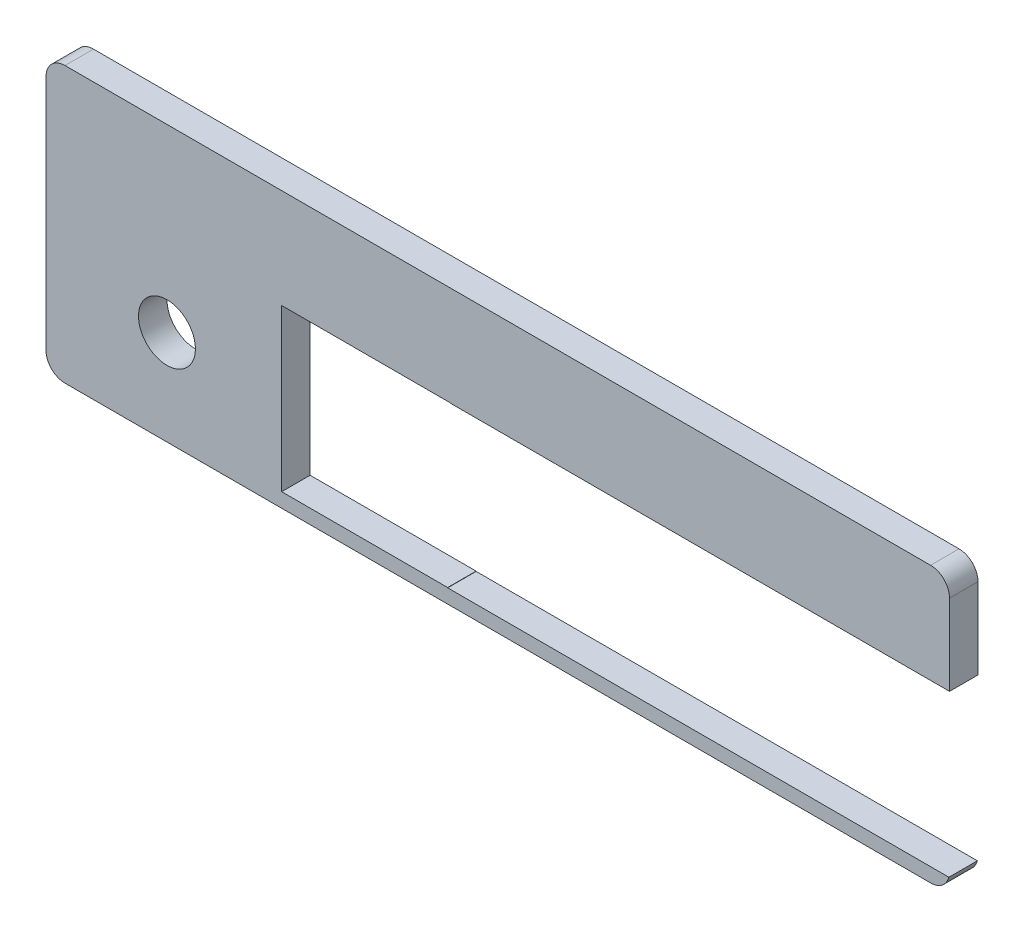
ISO-10303-21;
HEADER;
FILE_DESCRIPTION(('STEP AP214'),'2;1');
FILE_NAME('part.step','',(''),(''),'','','');
FILE_SCHEMA(('AUTOMOTIVE_DESIGN { 1 0 10303 214 1 1 1 1 }'));
ENDSEC;
DATA;
#1=APPLICATION_CONTEXT('core data for automotive mechanical design processes');
#2=APPLICATION_PROTOCOL_DEFINITION('international standard','automotive_design',2000,#1);
#3=PRODUCT_CONTEXT('',#1,'mechanical');
#4=PRODUCT('Part','Part','',(#3));
#5=PRODUCT_RELATED_PRODUCT_CATEGORY('part','',(#4));
#6=PRODUCT_DEFINITION_FORMATION('','',#4);
#7=PRODUCT_DEFINITION_CONTEXT('part definition',#1,'design');
#8=PRODUCT_DEFINITION('design','',#6,#7);
#9=PRODUCT_DEFINITION_SHAPE('','',#8);
#10=(LENGTH_UNIT() NAMED_UNIT(*) SI_UNIT(.MILLI.,.METRE.));
#11=(NAMED_UNIT(*) PLANE_ANGLE_UNIT() SI_UNIT($,.RADIAN.));
#12=(NAMED_UNIT(*) SI_UNIT($,.STERADIAN.) SOLID_ANGLE_UNIT());
#13=UNCERTAINTY_MEASURE_WITH_UNIT(LENGTH_MEASURE(1.E-05),#10,'distance_accuracy_value','');
#14=(GEOMETRIC_REPRESENTATION_CONTEXT(3) GLOBAL_UNCERTAINTY_ASSIGNED_CONTEXT((#13)) GLOBAL_UNIT_ASSIGNED_CONTEXT((#10,
#11,#12)) REPRESENTATION_CONTEXT('',''));
#15=CARTESIAN_POINT('',(0.,0.,0.));
#16=DIRECTION('',(0.,0.,1.));
#17=DIRECTION('',(1.,0.,0.));
#18=AXIS2_PLACEMENT_3D('',#15,#16,#17);
#19=CARTESIAN_POINT('',(46.,0.,3.));
#20=DIRECTION('',(-1.,0.,0.));
#21=DIRECTION('',(0.,0.,1.));
#22=AXIS2_PLACEMENT_3D('',#19,#20,#21);
#23=PLANE('',#22);
#24=DIRECTION('',(0.,1.,0.));
#25=VECTOR('',#24,1.);
#26=CARTESIAN_POINT('',(46.,0.,0.));
#27=LINE('',#26,#25);
#28=CARTESIAN_POINT('',(46.,9.23630902923453,0.));
#29=VERTEX_POINT('',#28);
#30=CARTESIAN_POINT('',(46.,17.75,0.));
#31=VERTEX_POINT('',#30);
#32=EDGE_CURVE('E177',#29,#31,#27,.T.);
#33=ORIENTED_EDGE('',*,*,#32,.T.);
#34=DIRECTION('',(0.,0.,-1.));
#35=VECTOR('',#34,1.);
#36=CARTESIAN_POINT('',(46.,17.75,3.));
#37=LINE('',#36,#35);
#38=CARTESIAN_POINT('',(46.,17.75,3.));
#39=VERTEX_POINT('',#38);
#40=EDGE_CURVE('E11',#39,#31,#37,.T.);
#41=ORIENTED_EDGE('',*,*,#40,.F.);
#42=DIRECTION('',(0.,1.,0.));
#43=VECTOR('',#42,1.);
#44=CARTESIAN_POINT('',(46.,0.,3.));
#45=LINE('',#44,#43);
#46=CARTESIAN_POINT('',(46.,9.23630902923453,3.));
#47=VERTEX_POINT('',#46);
#48=EDGE_CURVE('E474',#47,#39,#45,.T.);
#49=ORIENTED_EDGE('',*,*,#48,.F.);
#50=DIRECTION('',(0.,0.,-1.));
#51=VECTOR('',#50,1.);
#52=CARTESIAN_POINT('',(46.,9.23630902923453,3.));
#53=LINE('',#52,#51);
#54=EDGE_CURVE('E51',#47,#29,#53,.T.);
#55=ORIENTED_EDGE('',*,*,#54,.T.);
#56=EDGE_LOOP('',(#33,#41,#49,#55));
#57=FACE_BOUND('',#56,.T.);
#58=ADVANCED_FACE('F34',(#57),#23,.F.);
#59=CARTESIAN_POINT('',(44.,17.75,3.));
#60=DIRECTION('',(0.,0.,-1.));
#61=DIRECTION('',(-1.,0.,0.));
#62=AXIS2_PLACEMENT_3D('',#59,#60,#61);
#63=CYLINDRICAL_SURFACE('',#62,2.);
#64=CARTESIAN_POINT('',(44.,17.75,0.));
#65=DIRECTION('',(0.,0.,1.));
#66=DIRECTION('',(1.,0.,0.));
#67=AXIS2_PLACEMENT_3D('',#64,#65,#66);
#68=CIRCLE('',#67,2.);
#69=CARTESIAN_POINT('',(44.,19.75,0.));
#70=VERTEX_POINT('',#69);
#71=EDGE_CURVE('E179',#31,#70,#68,.T.);
#72=ORIENTED_EDGE('',*,*,#71,.T.);
#73=DIRECTION('',(0.,0.,-1.));
#74=VECTOR('',#73,1.);
#75=CARTESIAN_POINT('',(44.,19.75,3.));
#76=LINE('',#75,#74);
#77=CARTESIAN_POINT('',(44.,19.75,3.));
#78=VERTEX_POINT('',#77);
#79=EDGE_CURVE('E43',#78,#70,#76,.T.);
#80=ORIENTED_EDGE('',*,*,#79,.F.);
#81=CARTESIAN_POINT('',(44.,17.75,3.));
#82=DIRECTION('',(0.,0.,1.));
#83=DIRECTION('',(1.,0.,0.));
#84=AXIS2_PLACEMENT_3D('',#81,#82,#83);
#85=CIRCLE('',#84,2.);
#86=EDGE_CURVE('E110',#39,#78,#85,.T.);
#87=ORIENTED_EDGE('',*,*,#86,.F.);
#88=ORIENTED_EDGE('',*,*,#40,.T.);
#89=EDGE_LOOP('',(#72,#80,#87,#88));
#90=FACE_BOUND('',#89,.T.);
#91=ADVANCED_FACE('F296',(#90),#63,.T.);
#92=CARTESIAN_POINT('',(0.,19.75,3.));
#93=DIRECTION('',(0.,-1.,0.));
#94=DIRECTION('',(1.,0.,0.));
#95=AXIS2_PLACEMENT_3D('',#92,#93,#94);
#96=PLANE('',#95);
#97=DIRECTION('',(-1.,0.,0.));
#98=VECTOR('',#97,1.);
#99=CARTESIAN_POINT('',(0.,19.75,0.));
#100=LINE('',#99,#98);
#101=CARTESIAN_POINT('',(-47.25,19.75,0.));
#102=VERTEX_POINT('',#101);
#103=EDGE_CURVE('E181',#70,#102,#100,.T.);
#104=ORIENTED_EDGE('',*,*,#103,.T.);
#105=DIRECTION('',(0.,0.,-1.));
#106=VECTOR('',#105,1.);
#107=CARTESIAN_POINT('',(-47.25,19.75,3.));
#108=LINE('',#107,#106);
#109=CARTESIAN_POINT('',(-47.25,19.75,3.));
#110=VERTEX_POINT('',#109);
#111=EDGE_CURVE('E236',#110,#102,#108,.T.);
#112=ORIENTED_EDGE('',*,*,#111,.F.);
#113=DIRECTION('',(-1.,0.,0.));
#114=VECTOR('',#113,1.);
#115=CARTESIAN_POINT('',(0.,19.75,3.));
#116=LINE('',#115,#114);
#117=EDGE_CURVE('E244',#78,#110,#116,.T.);
#118=ORIENTED_EDGE('',*,*,#117,.F.);
#119=ORIENTED_EDGE('',*,*,#79,.T.);
#120=EDGE_LOOP('',(#104,#112,#118,#119));
#121=FACE_BOUND('',#120,.T.);
#122=ADVANCED_FACE('F242',(#121),#96,.F.);
#123=CARTESIAN_POINT('',(-47.25,17.75,3.));
#124=DIRECTION('',(0.,0.,-1.));
#125=DIRECTION('',(-1.,0.,0.));
#126=AXIS2_PLACEMENT_3D('',#123,#124,#125);
#127=CYLINDRICAL_SURFACE('',#126,2.00000000000001);
#128=CARTESIAN_POINT('',(-47.25,17.75,0.));
#129=DIRECTION('',(0.,0.,1.));
#130=DIRECTION('',(1.,0.,0.));
#131=AXIS2_PLACEMENT_3D('',#128,#129,#130);
#132=CIRCLE('',#131,2.00000000000001);
#133=CARTESIAN_POINT('',(-49.25,17.75,0.));
#134=VERTEX_POINT('',#133);
#135=EDGE_CURVE('E183',#102,#134,#132,.T.);
#136=ORIENTED_EDGE('',*,*,#135,.T.);
#137=DIRECTION('',(0.,0.,-1.));
#138=VECTOR('',#137,1.);
#139=CARTESIAN_POINT('',(-49.25,17.75,3.));
#140=LINE('',#139,#138);
#141=CARTESIAN_POINT('',(-49.25,17.75,3.));
#142=VERTEX_POINT('',#141);
#143=EDGE_CURVE('E233',#142,#134,#140,.T.);
#144=ORIENTED_EDGE('',*,*,#143,.F.);
#145=CARTESIAN_POINT('',(-47.25,17.75,3.));
#146=DIRECTION('',(0.,0.,1.));
#147=DIRECTION('',(1.,0.,0.));
#148=AXIS2_PLACEMENT_3D('',#145,#146,#147);
#149=CIRCLE('',#148,2.00000000000001);
#150=EDGE_CURVE('E261',#110,#142,#149,.T.);
#151=ORIENTED_EDGE('',*,*,#150,.F.);
#152=ORIENTED_EDGE('',*,*,#111,.T.);
#153=EDGE_LOOP('',(#136,#144,#151,#152));
#154=FACE_BOUND('',#153,.T.);
#155=ADVANCED_FACE('F252',(#154),#127,.T.);
#156=CARTESIAN_POINT('',(-49.25,0.,3.));
#157=DIRECTION('',(1.,0.,0.));
#158=DIRECTION('',(0.,1.,0.));
#159=AXIS2_PLACEMENT_3D('',#156,#157,#158);
#160=PLANE('',#159);
#161=DIRECTION('',(0.,-1.,0.));
#162=VECTOR('',#161,1.);
#163=CARTESIAN_POINT('',(-49.25,0.,0.));
#164=LINE('',#163,#162);
#165=CARTESIAN_POINT('',(-49.25,-7.25,0.));
#166=VERTEX_POINT('',#165);
#167=EDGE_CURVE('E185',#134,#166,#164,.T.);
#168=ORIENTED_EDGE('',*,*,#167,.T.);
#169=DIRECTION('',(0.,0.,-1.));
#170=VECTOR('',#169,1.);
#171=CARTESIAN_POINT('',(-49.25,-7.25,3.));
#172=LINE('',#171,#170);
#173=CARTESIAN_POINT('',(-49.25,-7.25,3.));
#174=VERTEX_POINT('',#173);
#175=EDGE_CURVE('E230',#174,#166,#172,.T.);
#176=ORIENTED_EDGE('',*,*,#175,.F.);
#177=DIRECTION('',(0.,-1.,0.));
#178=VECTOR('',#177,1.);
#179=CARTESIAN_POINT('',(-49.25,0.,3.));
#180=LINE('',#179,#178);
#181=EDGE_CURVE('E258',#142,#174,#180,.T.);
#182=ORIENTED_EDGE('',*,*,#181,.F.);
#183=ORIENTED_EDGE('',*,*,#143,.T.);
#184=EDGE_LOOP('',(#168,#176,#182,#183));
#185=FACE_BOUND('',#184,.T.);
#186=ADVANCED_FACE('F256',(#185),#160,.F.);
#187=CARTESIAN_POINT('',(-47.25,-7.25,3.));
#188=DIRECTION('',(0.,0.,-1.));
#189=DIRECTION('',(-1.,0.,0.));
#190=AXIS2_PLACEMENT_3D('',#187,#188,#189);
#191=CYLINDRICAL_SURFACE('',#190,1.99999999999999);
#192=CARTESIAN_POINT('',(-47.25,-7.25,0.));
#193=DIRECTION('',(0.,0.,1.));
#194=DIRECTION('',(1.,0.,0.));
#195=AXIS2_PLACEMENT_3D('',#192,#193,#194);
#196=CIRCLE('',#195,1.99999999999999);
#197=CARTESIAN_POINT('',(-47.25,-9.25,0.));
#198=VERTEX_POINT('',#197);
#199=EDGE_CURVE('E187',#166,#198,#196,.T.);
#200=ORIENTED_EDGE('',*,*,#199,.T.);
#201=DIRECTION('',(0.,0.,-1.));
#202=VECTOR('',#201,1.);
#203=CARTESIAN_POINT('',(-47.25,-9.25,3.));
#204=LINE('',#203,#202);
#205=CARTESIAN_POINT('',(-47.25,-9.25,3.));
#206=VERTEX_POINT('',#205);
#207=EDGE_CURVE('E227',#206,#198,#204,.T.);
#208=ORIENTED_EDGE('',*,*,#207,.F.);
#209=CARTESIAN_POINT('',(-47.25,-7.25,3.));
#210=DIRECTION('',(0.,0.,1.));
#211=DIRECTION('',(1.,0.,0.));
#212=AXIS2_PLACEMENT_3D('',#209,#210,#211);
#213=CIRCLE('',#212,1.99999999999999);
#214=EDGE_CURVE('E260',#174,#206,#213,.T.);
#215=ORIENTED_EDGE('',*,*,#214,.F.);
#216=ORIENTED_EDGE('',*,*,#175,.T.);
#217=EDGE_LOOP('',(#200,#208,#215,#216));
#218=FACE_BOUND('',#217,.T.);
#219=ADVANCED_FACE('F308',(#218),#191,.T.);
#220=CARTESIAN_POINT('',(0.,-9.25,3.));
#221=DIRECTION('',(0.,1.,0.));
#222=DIRECTION('',(-1.,0.,0.));
#223=AXIS2_PLACEMENT_3D('',#220,#221,#222);
#224=PLANE('',#223);
#225=DIRECTION('',(1.,0.,0.));
#226=VECTOR('',#225,1.);
#227=CARTESIAN_POINT('',(0.,-9.25,0.));
#228=LINE('',#227,#226);
#229=CARTESIAN_POINT('',(44.,-9.25,0.));
#230=VERTEX_POINT('',#229);
#231=EDGE_CURVE('E189',#198,#230,#228,.T.);
#232=ORIENTED_EDGE('',*,*,#231,.T.);
#233=DIRECTION('',(0.,0.,-1.));
#234=VECTOR('',#233,1.);
#235=CARTESIAN_POINT('',(44.,-9.25,3.));
#236=LINE('',#235,#234);
#237=CARTESIAN_POINT('',(44.,-9.25,3.));
#238=VERTEX_POINT('',#237);
#239=EDGE_CURVE('E224',#238,#230,#236,.T.);
#240=ORIENTED_EDGE('',*,*,#239,.F.);
#241=DIRECTION('',(1.,0.,0.));
#242=VECTOR('',#241,1.);
#243=CARTESIAN_POINT('',(0.,-9.25,3.));
#244=LINE('',#243,#242);
#245=EDGE_CURVE('E263',#206,#238,#244,.T.);
#246=ORIENTED_EDGE('',*,*,#245,.F.);
#247=ORIENTED_EDGE('',*,*,#207,.T.);
#248=EDGE_LOOP('',(#232,#240,#246,#247));
#249=FACE_BOUND('',#248,.T.);
#250=ADVANCED_FACE('F311',(#249),#224,.F.);
#251=CARTESIAN_POINT('',(44.,-7.25,3.));
#252=DIRECTION('',(0.,0.,-1.));
#253=DIRECTION('',(-1.,0.,0.));
#254=AXIS2_PLACEMENT_3D('',#251,#252,#253);
#255=CYLINDRICAL_SURFACE('',#254,2.);
#256=CARTESIAN_POINT('',(44.,-7.25,0.));
#257=DIRECTION('',(0.,0.,1.));
#258=DIRECTION('',(1.,0.,0.));
#259=AXIS2_PLACEMENT_3D('',#256,#257,#258);
#260=CIRCLE('',#259,2.);
#261=CARTESIAN_POINT('',(45.9329049605591,-7.76369097076548,0.));
#262=VERTEX_POINT('',#261);
#263=EDGE_CURVE('E191',#230,#262,#260,.T.);
#264=ORIENTED_EDGE('',*,*,#263,.T.);
#265=DIRECTION('',(0.,0.,-1.));
#266=VECTOR('',#265,1.);
#267=CARTESIAN_POINT('',(45.9329049605591,-7.76369097076548,3.));
#268=LINE('',#267,#266);
#269=CARTESIAN_POINT('',(45.9329049605591,-7.76369097076548,3.));
#270=VERTEX_POINT('',#269);
#271=EDGE_CURVE('E222',#270,#262,#268,.T.);
#272=ORIENTED_EDGE('',*,*,#271,.F.);
#273=CARTESIAN_POINT('',(44.,-7.25,3.));
#274=DIRECTION('',(0.,0.,1.));
#275=DIRECTION('',(1.,0.,0.));
#276=AXIS2_PLACEMENT_3D('',#273,#274,#275);
#277=CIRCLE('',#276,2.);
#278=EDGE_CURVE('E269',#238,#270,#277,.T.);
#279=ORIENTED_EDGE('',*,*,#278,.F.);
#280=ORIENTED_EDGE('',*,*,#239,.T.);
#281=EDGE_LOOP('',(#264,#272,#279,#280));
#282=FACE_BOUND('',#281,.T.);
#283=ADVANCED_FACE('F315',(#282),#255,.T.);
#284=CARTESIAN_POINT('',(0.,-7.76369097076548,3.));
#285=DIRECTION('',(0.,1.,0.));
#286=DIRECTION('',(0.,0.,1.));
#287=AXIS2_PLACEMENT_3D('',#284,#285,#286);
#288=PLANE('',#287);
#289=DIRECTION('',(1.,0.,0.));
#290=VECTOR('',#289,1.);
#291=CARTESIAN_POINT('',(0.,-7.76369097076548,0.));
#292=LINE('',#291,#290);
#293=CARTESIAN_POINT('',(-6.90750269123254,-7.76369097076548,0.));
#294=VERTEX_POINT('',#293);
#295=EDGE_CURVE('E194',#294,#262,#292,.T.);
#296=ORIENTED_EDGE('',*,*,#295,.F.);
#297=DIRECTION('',(0.,0.,-1.));
#298=VECTOR('',#297,1.);
#299=CARTESIAN_POINT('',(-6.90750269123254,-7.76369097076548,3.));
#300=LINE('',#299,#298);
#301=CARTESIAN_POINT('',(-6.90750269123254,-7.76369097076548,3.));
#302=VERTEX_POINT('',#301);
#303=EDGE_CURVE('E220',#302,#294,#300,.T.);
#304=ORIENTED_EDGE('',*,*,#303,.F.);
#305=DIRECTION('',(1.,0.,0.));
#306=VECTOR('',#305,1.);
#307=CARTESIAN_POINT('',(0.,-7.76369097076548,3.));
#308=LINE('',#307,#306);
#309=EDGE_CURVE('E271',#302,#270,#308,.T.);
#310=ORIENTED_EDGE('',*,*,#309,.T.);
#311=ORIENTED_EDGE('',*,*,#271,.T.);
#312=EDGE_LOOP('',(#296,#304,#310,#311));
#313=FACE_BOUND('',#312,.T.);
#314=ADVANCED_FACE('F319',(#313),#288,.T.);
#315=CARTESIAN_POINT('',(-6.90750269123229,2.1880492048964E-13,3.));
#316=DIRECTION('',(1.,0.,0.));
#317=DIRECTION('',(0.,1.,0.));
#318=AXIS2_PLACEMENT_3D('',#315,#316,#317);
#319=PLANE('',#318);
#320=DIRECTION('',(0.,-1.,0.));
#321=VECTOR('',#320,1.);
#322=CARTESIAN_POINT('',(-6.90750269123229,2.1880492048964E-13,0.));
#323=LINE('',#322,#321);
#324=CARTESIAN_POINT('',(-6.90750269123254,-7.73630902923501,0.));
#325=VERTEX_POINT('',#324);
#326=EDGE_CURVE('E197',#325,#294,#323,.T.);
#327=ORIENTED_EDGE('',*,*,#326,.F.);
#328=DIRECTION('',(0.,0.,-1.));
#329=VECTOR('',#328,1.);
#330=CARTESIAN_POINT('',(-6.90750269123254,-7.73630902923501,3.));
#331=LINE('',#330,#329);
#332=CARTESIAN_POINT('',(-6.90750269123254,-7.73630902923501,3.));
#333=VERTEX_POINT('',#332);
#334=EDGE_CURVE('E218',#333,#325,#331,.T.);
#335=ORIENTED_EDGE('',*,*,#334,.F.);
#336=DIRECTION('',(0.,-1.,0.));
#337=VECTOR('',#336,1.);
#338=CARTESIAN_POINT('',(-6.90750269123229,2.1880492048964E-13,3.));
#339=LINE('',#338,#337);
#340=EDGE_CURVE('E274',#333,#302,#339,.T.);
#341=ORIENTED_EDGE('',*,*,#340,.T.);
#342=ORIENTED_EDGE('',*,*,#303,.T.);
#343=EDGE_LOOP('',(#327,#335,#341,#342));
#344=FACE_BOUND('',#343,.T.);
#345=ADVANCED_FACE('F323',(#344),#319,.T.);
#346=CARTESIAN_POINT('',(0.,-7.73630902923501,3.));
#347=DIRECTION('',(0.,1.,0.));
#348=DIRECTION('',(0.,0.,1.));
#349=AXIS2_PLACEMENT_3D('',#346,#347,#348);
#350=PLANE('',#349);
#351=DIRECTION('',(1.,0.,0.));
#352=VECTOR('',#351,1.);
#353=CARTESIAN_POINT('',(0.,-7.73630902923501,0.));
#354=LINE('',#353,#352);
#355=CARTESIAN_POINT('',(-24.4064374737797,-7.73630902923501,0.));
#356=VERTEX_POINT('',#355);
#357=EDGE_CURVE('E200',#356,#325,#354,.T.);
#358=ORIENTED_EDGE('',*,*,#357,.F.);
#359=DIRECTION('',(0.,0.,-1.));
#360=VECTOR('',#359,1.);
#361=CARTESIAN_POINT('',(-24.4064374737797,-7.73630902923501,3.));
#362=LINE('',#361,#360);
#363=CARTESIAN_POINT('',(-24.4064374737797,-7.73630902923501,3.));
#364=VERTEX_POINT('',#363);
#365=EDGE_CURVE('E216',#364,#356,#362,.T.);
#366=ORIENTED_EDGE('',*,*,#365,.F.);
#367=DIRECTION('',(1.,0.,0.));
#368=VECTOR('',#367,1.);
#369=CARTESIAN_POINT('',(0.,-7.73630902923501,3.));
#370=LINE('',#369,#368);
#371=EDGE_CURVE('E277',#364,#333,#370,.T.);
#372=ORIENTED_EDGE('',*,*,#371,.T.);
#373=ORIENTED_EDGE('',*,*,#334,.T.);
#374=EDGE_LOOP('',(#358,#366,#372,#373));
#375=FACE_BOUND('',#374,.T.);
#376=ADVANCED_FACE('F327',(#375),#350,.T.);
#377=CARTESIAN_POINT('',(-24.4064374737797,0.,3.));
#378=DIRECTION('',(1.,0.,0.));
#379=DIRECTION('',(0.,1.,0.));
#380=AXIS2_PLACEMENT_3D('',#377,#378,#379);
#381=PLANE('',#380);
#382=DIRECTION('',(0.,-1.,0.));
#383=VECTOR('',#382,1.);
#384=CARTESIAN_POINT('',(-24.4064374737797,0.,0.));
#385=LINE('',#384,#383);
#386=CARTESIAN_POINT('',(-24.4064374737798,9.263690970765,0.));
#387=VERTEX_POINT('',#386);
#388=EDGE_CURVE('E203',#387,#356,#385,.T.);
#389=ORIENTED_EDGE('',*,*,#388,.F.);
#390=DIRECTION('',(0.,0.,-1.));
#391=VECTOR('',#390,1.);
#392=CARTESIAN_POINT('',(-24.4064374737798,9.263690970765,3.));
#393=LINE('',#392,#391);
#394=CARTESIAN_POINT('',(-24.4064374737798,9.263690970765,3.));
#395=VERTEX_POINT('',#394);
#396=EDGE_CURVE('E156',#395,#387,#393,.T.);
#397=ORIENTED_EDGE('',*,*,#396,.F.);
#398=DIRECTION('',(0.,-1.,0.));
#399=VECTOR('',#398,1.);
#400=CARTESIAN_POINT('',(-24.4064374737797,0.,3.));
#401=LINE('',#400,#399);
#402=EDGE_CURVE('E166',#395,#364,#401,.T.);
#403=ORIENTED_EDGE('',*,*,#402,.T.);
#404=ORIENTED_EDGE('',*,*,#365,.T.);
#405=EDGE_LOOP('',(#389,#397,#403,#404));
#406=FACE_BOUND('',#405,.T.);
#407=ADVANCED_FACE('F281',(#406),#381,.T.);
#408=CARTESIAN_POINT('',(0.,9.263690970765,3.));
#409=DIRECTION('',(0.,-1.,0.));
#410=DIRECTION('',(0.,0.,-1.));
#411=AXIS2_PLACEMENT_3D('',#408,#409,#410);
#412=PLANE('',#411);
#413=DIRECTION('',(-1.,0.,0.));
#414=VECTOR('',#413,1.);
#415=CARTESIAN_POINT('',(0.,9.263690970765,0.));
#416=LINE('',#415,#414);
#417=CARTESIAN_POINT('',(-6.59249730876818,9.263690970765,0.));
#418=VERTEX_POINT('',#417);
#419=EDGE_CURVE('E152',#418,#387,#416,.T.);
#420=ORIENTED_EDGE('',*,*,#419,.F.);
#421=DIRECTION('',(0.,0.,-1.));
#422=VECTOR('',#421,1.);
#423=CARTESIAN_POINT('',(-6.59249730876818,9.263690970765,3.));
#424=LINE('',#423,#422);
#425=CARTESIAN_POINT('',(-6.59249730876818,9.263690970765,3.));
#426=VERTEX_POINT('',#425);
#427=EDGE_CURVE('E147',#426,#418,#424,.T.);
#428=ORIENTED_EDGE('',*,*,#427,.F.);
#429=DIRECTION('',(-1.,0.,0.));
#430=VECTOR('',#429,1.);
#431=CARTESIAN_POINT('',(0.,9.263690970765,3.));
#432=LINE('',#431,#430);
#433=EDGE_CURVE('E150',#426,#395,#432,.T.);
#434=ORIENTED_EDGE('',*,*,#433,.T.);
#435=ORIENTED_EDGE('',*,*,#396,.T.);
#436=EDGE_LOOP('',(#420,#428,#434,#435));
#437=FACE_BOUND('',#436,.T.);
#438=ADVANCED_FACE('F149',(#437),#412,.T.);
#439=CARTESIAN_POINT('',(-6.59249730876847,2.08826679330039E-13,3.));
#440=DIRECTION('',(-1.,0.,0.));
#441=DIRECTION('',(0.,-1.,0.));
#442=AXIS2_PLACEMENT_3D('',#439,#440,#441);
#443=PLANE('',#442);
#444=DIRECTION('',(0.,1.,0.));
#445=VECTOR('',#444,1.);
#446=CARTESIAN_POINT('',(-6.59249730876847,2.08826679330039E-13,0.));
#447=LINE('',#446,#445);
#448=CARTESIAN_POINT('',(-6.59249730876818,9.23630902923453,0.));
#449=VERTEX_POINT('',#448);
#450=EDGE_CURVE('E207',#449,#418,#447,.T.);
#451=ORIENTED_EDGE('',*,*,#450,.F.);
#452=DIRECTION('',(0.,0.,-1.));
#453=VECTOR('',#452,1.);
#454=CARTESIAN_POINT('',(-6.59249730876818,9.23630902923453,3.));
#455=LINE('',#454,#453);
#456=CARTESIAN_POINT('',(-6.59249730876818,9.23630902923453,3.));
#457=VERTEX_POINT('',#456);
#458=EDGE_CURVE('E98',#457,#449,#455,.T.);
#459=ORIENTED_EDGE('',*,*,#458,.F.);
#460=DIRECTION('',(0.,1.,0.));
#461=VECTOR('',#460,1.);
#462=CARTESIAN_POINT('',(-6.59249730876847,2.08826679330039E-13,3.));
#463=LINE('',#462,#461);
#464=EDGE_CURVE('E163',#457,#426,#463,.T.);
#465=ORIENTED_EDGE('',*,*,#464,.T.);
#466=ORIENTED_EDGE('',*,*,#427,.T.);
#467=EDGE_LOOP('',(#451,#459,#465,#466));
#468=FACE_BOUND('',#467,.T.);
#469=ADVANCED_FACE('F168',(#468),#443,.T.);
#470=CARTESIAN_POINT('',(-36.5,0.749999999999983,3.));
#471=DIRECTION('',(0.,0.,-1.));
#472=DIRECTION('',(-1.,0.,0.));
#473=AXIS2_PLACEMENT_3D('',#470,#471,#472);
#474=CYLINDRICAL_SURFACE('',#473,3.);
#475=CARTESIAN_POINT('',(-36.5,0.749999999999983,3.));
#476=DIRECTION('',(0.,0.,1.));
#477=DIRECTION('',(1.,0.,0.));
#478=AXIS2_PLACEMENT_3D('',#475,#476,#477);
#479=CIRCLE('',#478,3.);
#480=CARTESIAN_POINT('',(-33.5,0.749999999999983,3.));
#481=VERTEX_POINT('',#480);
#482=EDGE_CURVE('E212',#481,#481,#479,.T.);
#483=ORIENTED_EDGE('',*,*,#482,.T.);
#484=EDGE_LOOP('',(#483));
#485=FACE_BOUND('',#484,.T.);
#486=CARTESIAN_POINT('',(-36.5,0.749999999999983,0.));
#487=DIRECTION('',(0.,0.,1.));
#488=DIRECTION('',(1.,0.,0.));
#489=AXIS2_PLACEMENT_3D('',#486,#487,#488);
#490=CIRCLE('',#489,3.);
#491=CARTESIAN_POINT('',(-33.5,0.749999999999983,0.));
#492=VERTEX_POINT('',#491);
#493=EDGE_CURVE('E174',#492,#492,#490,.T.);
#494=ORIENTED_EDGE('',*,*,#493,.F.);
#495=EDGE_LOOP('',(#494));
#496=FACE_BOUND('',#495,.T.);
#497=ADVANCED_FACE('F36',(#485,#496),#474,.F.);
#498=CARTESIAN_POINT('',(0.,9.23630902923453,3.));
#499=DIRECTION('',(0.,-1.,0.));
#500=DIRECTION('',(0.,0.,-1.));
#501=AXIS2_PLACEMENT_3D('',#498,#499,#500);
#502=PLANE('',#501);
#503=DIRECTION('',(-1.,0.,0.));
#504=VECTOR('',#503,1.);
#505=CARTESIAN_POINT('',(0.,9.23630902923453,0.));
#506=LINE('',#505,#504);
#507=EDGE_CURVE('E209',#29,#449,#506,.T.);
#508=ORIENTED_EDGE('',*,*,#507,.F.);
#509=ORIENTED_EDGE('',*,*,#54,.F.);
#510=DIRECTION('',(-1.,0.,0.));
#511=VECTOR('',#510,1.);
#512=CARTESIAN_POINT('',(0.,9.23630902923453,3.));
#513=LINE('',#512,#511);
#514=EDGE_CURVE('E169',#47,#457,#513,.T.);
#515=ORIENTED_EDGE('',*,*,#514,.T.);
#516=ORIENTED_EDGE('',*,*,#458,.T.);
#517=EDGE_LOOP('',(#508,#509,#515,#516));
#518=FACE_BOUND('',#517,.T.);
#519=ADVANCED_FACE('F283',(#518),#502,.T.);
#520=CARTESIAN_POINT('',(0.,0.,3.));
#521=DIRECTION('',(0.,0.,1.));
#522=DIRECTION('',(1.,0.,0.));
#523=AXIS2_PLACEMENT_3D('',#520,#521,#522);
#524=PLANE('',#523);
#525=ORIENTED_EDGE('',*,*,#482,.F.);
#526=EDGE_LOOP('',(#525));
#527=FACE_BOUND('',#526,.T.);
#528=ORIENTED_EDGE('',*,*,#48,.T.);
#529=ORIENTED_EDGE('',*,*,#86,.T.);
#530=ORIENTED_EDGE('',*,*,#117,.T.);
#531=ORIENTED_EDGE('',*,*,#150,.T.);
#532=ORIENTED_EDGE('',*,*,#181,.T.);
#533=ORIENTED_EDGE('',*,*,#214,.T.);
#534=ORIENTED_EDGE('',*,*,#245,.T.);
#535=ORIENTED_EDGE('',*,*,#278,.T.);
#536=ORIENTED_EDGE('',*,*,#309,.F.);
#537=ORIENTED_EDGE('',*,*,#340,.F.);
#538=ORIENTED_EDGE('',*,*,#371,.F.);
#539=ORIENTED_EDGE('',*,*,#402,.F.);
#540=ORIENTED_EDGE('',*,*,#433,.F.);
#541=ORIENTED_EDGE('',*,*,#464,.F.);
#542=ORIENTED_EDGE('',*,*,#514,.F.);
#543=EDGE_LOOP('',(#528,#529,#530,#531,#532,#533,#534,#535,#536,#537,#538,#539,#540,#541,#542));
#544=FACE_BOUND('',#543,.T.);
#545=ADVANCED_FACE('F161',(#527,#544),#524,.T.);
#546=CARTESIAN_POINT('',(0.,0.,0.));
#547=DIRECTION('',(0.,0.,1.));
#548=DIRECTION('',(1.,0.,0.));
#549=AXIS2_PLACEMENT_3D('',#546,#547,#548);
#550=PLANE('',#549);
#551=ORIENTED_EDGE('',*,*,#493,.T.);
#552=EDGE_LOOP('',(#551));
#553=FACE_BOUND('',#552,.T.);
#554=ORIENTED_EDGE('',*,*,#32,.F.);
#555=ORIENTED_EDGE('',*,*,#507,.T.);
#556=ORIENTED_EDGE('',*,*,#450,.T.);
#557=ORIENTED_EDGE('',*,*,#419,.T.);
#558=ORIENTED_EDGE('',*,*,#388,.T.);
#559=ORIENTED_EDGE('',*,*,#357,.T.);
#560=ORIENTED_EDGE('',*,*,#326,.T.);
#561=ORIENTED_EDGE('',*,*,#295,.T.);
#562=ORIENTED_EDGE('',*,*,#263,.F.);
#563=ORIENTED_EDGE('',*,*,#231,.F.);
#564=ORIENTED_EDGE('',*,*,#199,.F.);
#565=ORIENTED_EDGE('',*,*,#167,.F.);
#566=ORIENTED_EDGE('',*,*,#135,.F.);
#567=ORIENTED_EDGE('',*,*,#103,.F.);
#568=ORIENTED_EDGE('',*,*,#71,.F.);
#569=EDGE_LOOP('',(#554,#555,#556,#557,#558,#559,#560,#561,#562,#563,#564,#565,#566,#567,#568));
#570=FACE_BOUND('',#569,.T.);
#571=ADVANCED_FACE('F247',(#553,#570),#550,.F.);
#572=CLOSED_SHELL('',(#58,#91,#122,#155,#186,#219,#250,#283,#314,#345,#376,#407,#438,#469,#497,
#519,#545,#571));
#573=MANIFOLD_SOLID_BREP('B2',#572);
#574=ADVANCED_BREP_SHAPE_REPRESENTATION('',(#18,#573),#14);
#575=SHAPE_DEFINITION_REPRESENTATION(#9,#574);
ENDSEC;
END-ISO-10303-21;
